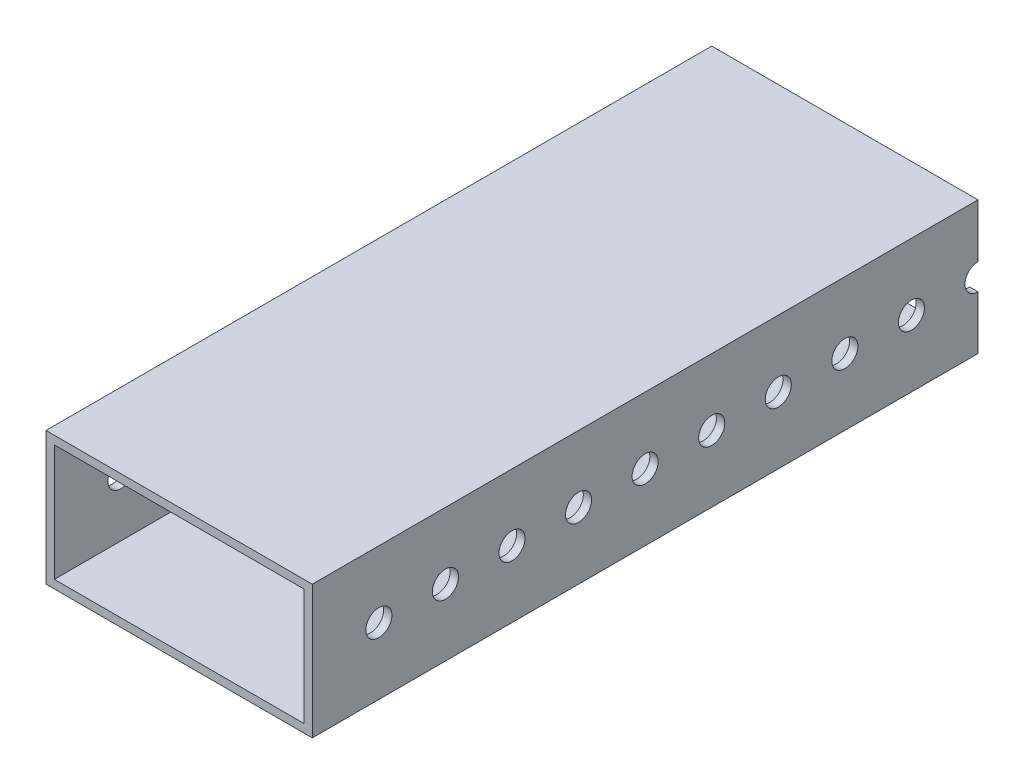
ISO-10303-21;
HEADER;
FILE_DESCRIPTION(('STEP AP214'),'2;1');
FILE_NAME('part.step','',(''),(''),'','','');
FILE_SCHEMA(('AUTOMOTIVE_DESIGN { 1 0 10303 214 1 1 1 1 }'));
ENDSEC;
DATA;
#1=APPLICATION_CONTEXT('core data for automotive mechanical design processes');
#2=APPLICATION_PROTOCOL_DEFINITION('international standard','automotive_design',2000,#1);
#3=PRODUCT_CONTEXT('',#1,'mechanical');
#4=PRODUCT('Part','Part','',(#3));
#5=PRODUCT_RELATED_PRODUCT_CATEGORY('part','',(#4));
#6=PRODUCT_DEFINITION_FORMATION('','',#4);
#7=PRODUCT_DEFINITION_CONTEXT('part definition',#1,'design');
#8=PRODUCT_DEFINITION('design','',#6,#7);
#9=PRODUCT_DEFINITION_SHAPE('','',#8);
#10=(LENGTH_UNIT() NAMED_UNIT(*) SI_UNIT(.MILLI.,.METRE.));
#11=(NAMED_UNIT(*) PLANE_ANGLE_UNIT() SI_UNIT($,.RADIAN.));
#12=(NAMED_UNIT(*) SI_UNIT($,.STERADIAN.) SOLID_ANGLE_UNIT());
#13=UNCERTAINTY_MEASURE_WITH_UNIT(LENGTH_MEASURE(1.E-05),#10,'distance_accuracy_value','');
#14=(GEOMETRIC_REPRESENTATION_CONTEXT(3) GLOBAL_UNCERTAINTY_ASSIGNED_CONTEXT((#13)) GLOBAL_UNIT_ASSIGNED_CONTEXT((#10,
#11,#12)) REPRESENTATION_CONTEXT('',''));
#15=CARTESIAN_POINT('',(0.,0.,0.));
#16=DIRECTION('',(0.,0.,1.));
#17=DIRECTION('',(1.,0.,0.));
#18=AXIS2_PLACEMENT_3D('',#15,#16,#17);
#19=CARTESIAN_POINT('',(0.,0.,0.));
#20=DIRECTION('',(0.,0.,-1.));
#21=DIRECTION('',(-1.,0.,0.));
#22=AXIS2_PLACEMENT_3D('',#19,#20,#21);
#23=PLANE('',#22);
#24=DIRECTION('',(1.,0.,0.));
#25=VECTOR('',#24,1.);
#26=CARTESIAN_POINT('',(0.,15.1892,0.));
#27=LINE('',#26,#25);
#28=CARTESIAN_POINT('',(0.,15.1892,0.));
#29=VERTEX_POINT('',#28);
#30=CARTESIAN_POINT('',(1.5875,15.1892,0.));
#31=VERTEX_POINT('',#30);
#32=EDGE_CURVE('E63',#29,#31,#27,.T.);
#33=ORIENTED_EDGE('',*,*,#32,.F.);
#34=DIRECTION('',(0.,-1.,0.));
#35=VECTOR('',#34,1.);
#36=CARTESIAN_POINT('',(0.,0.,0.));
#37=LINE('',#36,#35);
#38=CARTESIAN_POINT('',(0.,25.4,0.));
#39=VERTEX_POINT('',#38);
#40=EDGE_CURVE('E148',#39,#29,#37,.T.);
#41=ORIENTED_EDGE('',*,*,#40,.F.);
#42=DIRECTION('',(-1.,0.,0.));
#43=VECTOR('',#42,1.);
#44=CARTESIAN_POINT('',(0.,25.4,0.));
#45=LINE('',#44,#43);
#46=CARTESIAN_POINT('',(50.8,25.4,0.));
#47=VERTEX_POINT('',#46);
#48=EDGE_CURVE('E176',#47,#39,#45,.T.);
#49=ORIENTED_EDGE('',*,*,#48,.F.);
#50=DIRECTION('',(0.,1.,0.));
#51=VECTOR('',#50,1.);
#52=CARTESIAN_POINT('',(50.8,0.,0.));
#53=LINE('',#52,#51);
#54=CARTESIAN_POINT('',(50.8,15.1892,0.));
#55=VERTEX_POINT('',#54);
#56=EDGE_CURVE('E165',#55,#47,#53,.T.);
#57=ORIENTED_EDGE('',*,*,#56,.F.);
#58=CARTESIAN_POINT('',(49.2125,15.1892,0.));
#59=VERTEX_POINT('',#58);
#60=EDGE_CURVE('E154',#59,#55,#27,.T.);
#61=ORIENTED_EDGE('',*,*,#60,.F.);
#62=DIRECTION('',(0.,1.,0.));
#63=VECTOR('',#62,1.);
#64=CARTESIAN_POINT('',(49.2125,1.5875,0.));
#65=LINE('',#64,#63);
#66=CARTESIAN_POINT('',(49.2125,23.8125,0.));
#67=VERTEX_POINT('',#66);
#68=EDGE_CURVE('E269',#59,#67,#65,.T.);
#69=ORIENTED_EDGE('',*,*,#68,.T.);
#70=DIRECTION('',(-1.,0.,0.));
#71=VECTOR('',#70,1.);
#72=CARTESIAN_POINT('',(1.5875,23.8125,0.));
#73=LINE('',#72,#71);
#74=CARTESIAN_POINT('',(1.5875,23.8125,0.));
#75=VERTEX_POINT('',#74);
#76=EDGE_CURVE('E252',#67,#75,#73,.T.);
#77=ORIENTED_EDGE('',*,*,#76,.T.);
#78=DIRECTION('',(0.,-1.,0.));
#79=VECTOR('',#78,1.);
#80=CARTESIAN_POINT('',(1.5875,1.5875,0.));
#81=LINE('',#80,#79);
#82=EDGE_CURVE('E150',#75,#31,#81,.T.);
#83=ORIENTED_EDGE('',*,*,#82,.T.);
#84=EDGE_LOOP('',(#33,#41,#49,#57,#61,#69,#77,#83));
#85=FACE_BOUND('',#84,.T.);
#86=ADVANCED_FACE('F45',(#85),#23,.T.);
#87=CARTESIAN_POINT('',(0.,0.,127.));
#88=DIRECTION('',(0.,0.,-1.));
#89=DIRECTION('',(-1.,0.,0.));
#90=AXIS2_PLACEMENT_3D('',#87,#88,#89);
#91=PLANE('',#90);
#92=DIRECTION('',(0.,-1.,0.));
#93=VECTOR('',#92,1.);
#94=CARTESIAN_POINT('',(0.,0.,127.));
#95=LINE('',#94,#93);
#96=CARTESIAN_POINT('',(0.,25.4,127.));
#97=VERTEX_POINT('',#96);
#98=CARTESIAN_POINT('',(0.,0.,127.));
#99=VERTEX_POINT('',#98);
#100=EDGE_CURVE('E179',#97,#99,#95,.T.);
#101=ORIENTED_EDGE('',*,*,#100,.T.);
#102=DIRECTION('',(1.,0.,0.));
#103=VECTOR('',#102,1.);
#104=CARTESIAN_POINT('',(0.,0.,127.));
#105=LINE('',#104,#103);
#106=CARTESIAN_POINT('',(50.8,0.,127.));
#107=VERTEX_POINT('',#106);
#108=EDGE_CURVE('E292',#99,#107,#105,.T.);
#109=ORIENTED_EDGE('',*,*,#108,.T.);
#110=DIRECTION('',(0.,1.,0.));
#111=VECTOR('',#110,1.);
#112=CARTESIAN_POINT('',(50.8,0.,127.));
#113=LINE('',#112,#111);
#114=CARTESIAN_POINT('',(50.8,25.4,127.));
#115=VERTEX_POINT('',#114);
#116=EDGE_CURVE('E294',#107,#115,#113,.T.);
#117=ORIENTED_EDGE('',*,*,#116,.T.);
#118=DIRECTION('',(-1.,0.,0.));
#119=VECTOR('',#118,1.);
#120=CARTESIAN_POINT('',(0.,25.4,127.));
#121=LINE('',#120,#119);
#122=EDGE_CURVE('E169',#115,#97,#121,.T.);
#123=ORIENTED_EDGE('',*,*,#122,.T.);
#124=EDGE_LOOP('',(#101,#109,#117,#123));
#125=FACE_BOUND('',#124,.T.);
#126=DIRECTION('',(0.,-1.,0.));
#127=VECTOR('',#126,1.);
#128=CARTESIAN_POINT('',(1.5875,1.5875,127.));
#129=LINE('',#128,#127);
#130=CARTESIAN_POINT('',(1.5875,23.8125,127.));
#131=VERTEX_POINT('',#130);
#132=CARTESIAN_POINT('',(1.5875,1.5875,127.));
#133=VERTEX_POINT('',#132);
#134=EDGE_CURVE('E248',#131,#133,#129,.T.);
#135=ORIENTED_EDGE('',*,*,#134,.F.);
#136=DIRECTION('',(-1.,0.,0.));
#137=VECTOR('',#136,1.);
#138=CARTESIAN_POINT('',(1.5875,23.8125,127.));
#139=LINE('',#138,#137);
#140=CARTESIAN_POINT('',(49.2125,23.8125,127.));
#141=VERTEX_POINT('',#140);
#142=EDGE_CURVE('E259',#141,#131,#139,.T.);
#143=ORIENTED_EDGE('',*,*,#142,.F.);
#144=DIRECTION('',(0.,1.,0.));
#145=VECTOR('',#144,1.);
#146=CARTESIAN_POINT('',(49.2125,1.5875,127.));
#147=LINE('',#146,#145);
#148=CARTESIAN_POINT('',(49.2125,1.5875,127.));
#149=VERTEX_POINT('',#148);
#150=EDGE_CURVE('E255',#149,#141,#147,.T.);
#151=ORIENTED_EDGE('',*,*,#150,.F.);
#152=DIRECTION('',(1.,0.,0.));
#153=VECTOR('',#152,1.);
#154=CARTESIAN_POINT('',(1.5875,1.5875,127.));
#155=LINE('',#154,#153);
#156=EDGE_CURVE('E251',#133,#149,#155,.T.);
#157=ORIENTED_EDGE('',*,*,#156,.F.);
#158=EDGE_LOOP('',(#135,#143,#151,#157));
#159=FACE_BOUND('',#158,.T.);
#160=ADVANCED_FACE('F301',(#125,#159),#91,.F.);
#161=DIRECTION('',(1.,0.,0.));
#162=VECTOR('',#161,1.);
#163=CARTESIAN_POINT('',(0.,10.2108,0.));
#164=LINE('',#163,#162);
#165=CARTESIAN_POINT('',(50.8,10.2108,0.));
#166=VERTEX_POINT('',#165);
#167=CARTESIAN_POINT('',(49.2125,10.2108,0.));
#168=VERTEX_POINT('',#167);
#169=EDGE_CURVE('E70',#166,#168,#164,.F.);
#170=ORIENTED_EDGE('',*,*,#169,.F.);
#171=CARTESIAN_POINT('',(50.8,0.,0.));
#172=VERTEX_POINT('',#171);
#173=EDGE_CURVE('E172',#172,#166,#53,.T.);
#174=ORIENTED_EDGE('',*,*,#173,.F.);
#175=DIRECTION('',(1.,0.,0.));
#176=VECTOR('',#175,1.);
#177=CARTESIAN_POINT('',(0.,0.,0.));
#178=LINE('',#177,#176);
#179=CARTESIAN_POINT('',(0.,0.,0.));
#180=VERTEX_POINT('',#179);
#181=EDGE_CURVE('E160',#180,#172,#178,.T.);
#182=ORIENTED_EDGE('',*,*,#181,.F.);
#183=CARTESIAN_POINT('',(0.,10.2108,0.));
#184=VERTEX_POINT('',#183);
#185=EDGE_CURVE('E161',#184,#180,#37,.T.);
#186=ORIENTED_EDGE('',*,*,#185,.F.);
#187=CARTESIAN_POINT('',(1.5875,10.2108,0.));
#188=VERTEX_POINT('',#187);
#189=EDGE_CURVE('E137',#188,#184,#164,.F.);
#190=ORIENTED_EDGE('',*,*,#189,.F.);
#191=CARTESIAN_POINT('',(1.5875,1.5875,0.));
#192=VERTEX_POINT('',#191);
#193=EDGE_CURVE('E247',#188,#192,#81,.T.);
#194=ORIENTED_EDGE('',*,*,#193,.T.);
#195=DIRECTION('',(1.,0.,0.));
#196=VECTOR('',#195,1.);
#197=CARTESIAN_POINT('',(1.5875,1.5875,0.));
#198=LINE('',#197,#196);
#199=CARTESIAN_POINT('',(49.2125,1.5875,0.));
#200=VERTEX_POINT('',#199);
#201=EDGE_CURVE('E265',#192,#200,#198,.T.);
#202=ORIENTED_EDGE('',*,*,#201,.T.);
#203=EDGE_CURVE('E270',#200,#168,#65,.T.);
#204=ORIENTED_EDGE('',*,*,#203,.T.);
#205=EDGE_LOOP('',(#170,#174,#182,#186,#190,#194,#202,#204));
#206=FACE_BOUND('',#205,.T.);
#207=ADVANCED_FACE('F418',(#206),#23,.T.);
#208=CARTESIAN_POINT('',(0.,0.,127.));
#209=DIRECTION('',(1.,0.,0.));
#210=DIRECTION('',(0.,1.,0.));
#211=AXIS2_PLACEMENT_3D('',#208,#209,#210);
#212=PLANE('',#211);
#213=CARTESIAN_POINT('',(0.,12.7,114.3));
#214=DIRECTION('',(1.,0.,0.));
#215=DIRECTION('',(0.,1.,0.));
#216=AXIS2_PLACEMENT_3D('',#213,#214,#215);
#217=CIRCLE('',#216,2.4892);
#218=CARTESIAN_POINT('',(0.,15.1892,114.3));
#219=VERTEX_POINT('',#218);
#220=EDGE_CURVE('E380',#219,#219,#217,.T.);
#221=ORIENTED_EDGE('',*,*,#220,.T.);
#222=EDGE_LOOP('',(#221));
#223=FACE_BOUND('',#222,.T.);
#224=CARTESIAN_POINT('',(0.,12.7,101.6));
#225=DIRECTION('',(1.,0.,0.));
#226=DIRECTION('',(0.,1.,0.));
#227=AXIS2_PLACEMENT_3D('',#224,#225,#226);
#228=CIRCLE('',#227,2.48920000000002);
#229=CARTESIAN_POINT('',(0.,15.1892,101.6));
#230=VERTEX_POINT('',#229);
#231=EDGE_CURVE('E432',#230,#230,#228,.T.);
#232=ORIENTED_EDGE('',*,*,#231,.T.);
#233=EDGE_LOOP('',(#232));
#234=FACE_BOUND('',#233,.T.);
#235=CARTESIAN_POINT('',(0.,12.7,88.9));
#236=DIRECTION('',(1.,0.,0.));
#237=DIRECTION('',(0.,1.,0.));
#238=AXIS2_PLACEMENT_3D('',#235,#236,#237);
#239=CIRCLE('',#238,2.4892);
#240=CARTESIAN_POINT('',(0.,15.1892,88.9));
#241=VERTEX_POINT('',#240);
#242=EDGE_CURVE('E440',#241,#241,#239,.T.);
#243=ORIENTED_EDGE('',*,*,#242,.T.);
#244=EDGE_LOOP('',(#243));
#245=FACE_BOUND('',#244,.T.);
#246=CARTESIAN_POINT('',(0.,12.7,76.2));
#247=DIRECTION('',(1.,0.,0.));
#248=DIRECTION('',(0.,1.,0.));
#249=AXIS2_PLACEMENT_3D('',#246,#247,#248);
#250=CIRCLE('',#249,2.4892);
#251=CARTESIAN_POINT('',(0.,15.1892,76.2));
#252=VERTEX_POINT('',#251);
#253=EDGE_CURVE('E448',#252,#252,#250,.T.);
#254=ORIENTED_EDGE('',*,*,#253,.T.);
#255=EDGE_LOOP('',(#254));
#256=FACE_BOUND('',#255,.T.);
#257=CARTESIAN_POINT('',(0.,12.7,63.5));
#258=DIRECTION('',(1.,0.,0.));
#259=DIRECTION('',(0.,1.,0.));
#260=AXIS2_PLACEMENT_3D('',#257,#258,#259);
#261=CIRCLE('',#260,2.4892);
#262=CARTESIAN_POINT('',(0.,15.1892,63.5));
#263=VERTEX_POINT('',#262);
#264=EDGE_CURVE('E456',#263,#263,#261,.T.);
#265=ORIENTED_EDGE('',*,*,#264,.T.);
#266=EDGE_LOOP('',(#265));
#267=FACE_BOUND('',#266,.T.);
#268=CARTESIAN_POINT('',(0.,12.7,50.8000000000001));
#269=DIRECTION('',(1.,0.,0.));
#270=DIRECTION('',(0.,1.,0.));
#271=AXIS2_PLACEMENT_3D('',#268,#269,#270);
#272=CIRCLE('',#271,2.4892);
#273=CARTESIAN_POINT('',(0.,15.1892,50.8000000000001));
#274=VERTEX_POINT('',#273);
#275=EDGE_CURVE('E464',#274,#274,#272,.T.);
#276=ORIENTED_EDGE('',*,*,#275,.T.);
#277=EDGE_LOOP('',(#276));
#278=FACE_BOUND('',#277,.T.);
#279=CARTESIAN_POINT('',(0.,12.7,38.1000000000001));
#280=DIRECTION('',(1.,0.,0.));
#281=DIRECTION('',(0.,1.,0.));
#282=AXIS2_PLACEMENT_3D('',#279,#280,#281);
#283=CIRCLE('',#282,2.4892);
#284=CARTESIAN_POINT('',(0.,15.1892,38.1000000000001));
#285=VERTEX_POINT('',#284);
#286=EDGE_CURVE('E472',#285,#285,#283,.T.);
#287=ORIENTED_EDGE('',*,*,#286,.T.);
#288=EDGE_LOOP('',(#287));
#289=FACE_BOUND('',#288,.T.);
#290=CARTESIAN_POINT('',(0.,12.7,25.4000000000001));
#291=DIRECTION('',(1.,0.,0.));
#292=DIRECTION('',(0.,1.,0.));
#293=AXIS2_PLACEMENT_3D('',#290,#291,#292);
#294=CIRCLE('',#293,2.4892);
#295=CARTESIAN_POINT('',(0.,15.1892,25.4000000000001));
#296=VERTEX_POINT('',#295);
#297=EDGE_CURVE('E365',#296,#296,#294,.T.);
#298=ORIENTED_EDGE('',*,*,#297,.T.);
#299=EDGE_LOOP('',(#298));
#300=FACE_BOUND('',#299,.T.);
#301=CARTESIAN_POINT('',(0.,12.7,12.7000000000001));
#302=DIRECTION('',(1.,0.,0.));
#303=DIRECTION('',(0.,1.,0.));
#304=AXIS2_PLACEMENT_3D('',#301,#302,#303);
#305=CIRCLE('',#304,2.4892);
#306=CARTESIAN_POINT('',(0.,15.1892,12.7000000000001));
#307=VERTEX_POINT('',#306);
#308=EDGE_CURVE('E366',#307,#307,#305,.T.);
#309=ORIENTED_EDGE('',*,*,#308,.T.);
#310=EDGE_LOOP('',(#309));
#311=FACE_BOUND('',#310,.T.);
#312=ORIENTED_EDGE('',*,*,#40,.T.);
#313=CARTESIAN_POINT('',(0.,12.7,0.));
#314=DIRECTION('',(1.,0.,0.));
#315=DIRECTION('',(0.,1.,0.));
#316=AXIS2_PLACEMENT_3D('',#313,#314,#315);
#317=CIRCLE('',#316,2.4892);
#318=EDGE_CURVE('E134',#29,#184,#317,.T.);
#319=ORIENTED_EDGE('',*,*,#318,.T.);
#320=ORIENTED_EDGE('',*,*,#185,.T.);
#321=DIRECTION('',(0.,0.,-1.));
#322=VECTOR('',#321,1.);
#323=CARTESIAN_POINT('',(0.,0.,127.));
#324=LINE('',#323,#322);
#325=EDGE_CURVE('E55',#99,#180,#324,.T.);
#326=ORIENTED_EDGE('',*,*,#325,.F.);
#327=ORIENTED_EDGE('',*,*,#100,.F.);
#328=DIRECTION('',(0.,0.,-1.));
#329=VECTOR('',#328,1.);
#330=CARTESIAN_POINT('',(0.,25.4,127.));
#331=LINE('',#330,#329);
#332=EDGE_CURVE('E158',#97,#39,#331,.T.);
#333=ORIENTED_EDGE('',*,*,#332,.T.);
#334=EDGE_LOOP('',(#312,#319,#320,#326,#327,#333));
#335=FACE_BOUND('',#334,.T.);
#336=ADVANCED_FACE('F47',(#223,#234,#245,#256,#267,#278,#289,#300,#311,#335),#212,.F.);
#337=CARTESIAN_POINT('',(0.,0.,127.));
#338=DIRECTION('',(0.,1.,0.));
#339=DIRECTION('',(0.,0.,1.));
#340=AXIS2_PLACEMENT_3D('',#337,#338,#339);
#341=PLANE('',#340);
#342=ORIENTED_EDGE('',*,*,#181,.T.);
#343=DIRECTION('',(0.,0.,-1.));
#344=VECTOR('',#343,1.);
#345=CARTESIAN_POINT('',(50.8,0.,127.));
#346=LINE('',#345,#344);
#347=EDGE_CURVE('E186',#107,#172,#346,.T.);
#348=ORIENTED_EDGE('',*,*,#347,.F.);
#349=ORIENTED_EDGE('',*,*,#108,.F.);
#350=ORIENTED_EDGE('',*,*,#325,.T.);
#351=EDGE_LOOP('',(#342,#348,#349,#350));
#352=FACE_BOUND('',#351,.T.);
#353=ADVANCED_FACE('F308',(#352),#341,.F.);
#354=CARTESIAN_POINT('',(50.8,0.,127.));
#355=DIRECTION('',(-1.,0.,0.));
#356=DIRECTION('',(0.,-1.,0.));
#357=AXIS2_PLACEMENT_3D('',#354,#355,#356);
#358=PLANE('',#357);
#359=CARTESIAN_POINT('',(50.8,12.7,114.3));
#360=DIRECTION('',(1.,0.,0.));
#361=DIRECTION('',(0.,1.,0.));
#362=AXIS2_PLACEMENT_3D('',#359,#360,#361);
#363=CIRCLE('',#362,2.4892);
#364=CARTESIAN_POINT('',(50.8,15.1892,114.3));
#365=VERTEX_POINT('',#364);
#366=EDGE_CURVE('E424',#365,#365,#363,.T.);
#367=ORIENTED_EDGE('',*,*,#366,.F.);
#368=EDGE_LOOP('',(#367));
#369=FACE_BOUND('',#368,.T.);
#370=CARTESIAN_POINT('',(50.8,12.7,101.6));
#371=DIRECTION('',(1.,0.,0.));
#372=DIRECTION('',(0.,1.,0.));
#373=AXIS2_PLACEMENT_3D('',#370,#371,#372);
#374=CIRCLE('',#373,2.48920000000002);
#375=CARTESIAN_POINT('',(50.8,15.1892,101.6));
#376=VERTEX_POINT('',#375);
#377=EDGE_CURVE('E428',#376,#376,#374,.T.);
#378=ORIENTED_EDGE('',*,*,#377,.F.);
#379=EDGE_LOOP('',(#378));
#380=FACE_BOUND('',#379,.T.);
#381=CARTESIAN_POINT('',(50.8,12.7,88.9));
#382=DIRECTION('',(1.,0.,0.));
#383=DIRECTION('',(0.,1.,0.));
#384=AXIS2_PLACEMENT_3D('',#381,#382,#383);
#385=CIRCLE('',#384,2.4892);
#386=CARTESIAN_POINT('',(50.8,15.1892,88.9));
#387=VERTEX_POINT('',#386);
#388=EDGE_CURVE('E436',#387,#387,#385,.T.);
#389=ORIENTED_EDGE('',*,*,#388,.F.);
#390=EDGE_LOOP('',(#389));
#391=FACE_BOUND('',#390,.T.);
#392=CARTESIAN_POINT('',(50.8,12.7,76.2));
#393=DIRECTION('',(1.,0.,0.));
#394=DIRECTION('',(0.,1.,0.));
#395=AXIS2_PLACEMENT_3D('',#392,#393,#394);
#396=CIRCLE('',#395,2.4892);
#397=CARTESIAN_POINT('',(50.8,15.1892,76.2));
#398=VERTEX_POINT('',#397);
#399=EDGE_CURVE('E444',#398,#398,#396,.T.);
#400=ORIENTED_EDGE('',*,*,#399,.F.);
#401=EDGE_LOOP('',(#400));
#402=FACE_BOUND('',#401,.T.);
#403=CARTESIAN_POINT('',(50.8,12.7,63.5));
#404=DIRECTION('',(1.,0.,0.));
#405=DIRECTION('',(0.,1.,0.));
#406=AXIS2_PLACEMENT_3D('',#403,#404,#405);
#407=CIRCLE('',#406,2.4892);
#408=CARTESIAN_POINT('',(50.8,15.1892,63.5));
#409=VERTEX_POINT('',#408);
#410=EDGE_CURVE('E452',#409,#409,#407,.T.);
#411=ORIENTED_EDGE('',*,*,#410,.F.);
#412=EDGE_LOOP('',(#411));
#413=FACE_BOUND('',#412,.T.);
#414=CARTESIAN_POINT('',(50.8,12.7,50.8000000000001));
#415=DIRECTION('',(1.,0.,0.));
#416=DIRECTION('',(0.,1.,0.));
#417=AXIS2_PLACEMENT_3D('',#414,#415,#416);
#418=CIRCLE('',#417,2.4892);
#419=CARTESIAN_POINT('',(50.8,15.1892,50.8000000000001));
#420=VERTEX_POINT('',#419);
#421=EDGE_CURVE('E460',#420,#420,#418,.T.);
#422=ORIENTED_EDGE('',*,*,#421,.F.);
#423=EDGE_LOOP('',(#422));
#424=FACE_BOUND('',#423,.T.);
#425=CARTESIAN_POINT('',(50.8,12.7,38.1000000000001));
#426=DIRECTION('',(1.,0.,0.));
#427=DIRECTION('',(0.,1.,0.));
#428=AXIS2_PLACEMENT_3D('',#425,#426,#427);
#429=CIRCLE('',#428,2.4892);
#430=CARTESIAN_POINT('',(50.8,15.1892,38.1000000000001));
#431=VERTEX_POINT('',#430);
#432=EDGE_CURVE('E468',#431,#431,#429,.T.);
#433=ORIENTED_EDGE('',*,*,#432,.F.);
#434=EDGE_LOOP('',(#433));
#435=FACE_BOUND('',#434,.T.);
#436=CARTESIAN_POINT('',(50.8,12.7,25.4000000000001));
#437=DIRECTION('',(1.,0.,0.));
#438=DIRECTION('',(0.,1.,0.));
#439=AXIS2_PLACEMENT_3D('',#436,#437,#438);
#440=CIRCLE('',#439,2.4892);
#441=CARTESIAN_POINT('',(50.8,15.1892,25.4000000000001));
#442=VERTEX_POINT('',#441);
#443=EDGE_CURVE('E371',#442,#442,#440,.T.);
#444=ORIENTED_EDGE('',*,*,#443,.F.);
#445=EDGE_LOOP('',(#444));
#446=FACE_BOUND('',#445,.T.);
#447=CARTESIAN_POINT('',(50.8,12.7,12.7000000000001));
#448=DIRECTION('',(1.,0.,0.));
#449=DIRECTION('',(0.,1.,0.));
#450=AXIS2_PLACEMENT_3D('',#447,#448,#449);
#451=CIRCLE('',#450,2.4892);
#452=CARTESIAN_POINT('',(50.8,15.1892,12.7000000000001));
#453=VERTEX_POINT('',#452);
#454=EDGE_CURVE('E362',#453,#453,#451,.T.);
#455=ORIENTED_EDGE('',*,*,#454,.F.);
#456=EDGE_LOOP('',(#455));
#457=FACE_BOUND('',#456,.T.);
#458=ORIENTED_EDGE('',*,*,#173,.T.);
#459=CARTESIAN_POINT('',(50.8,12.7,0.));
#460=DIRECTION('',(1.,0.,0.));
#461=DIRECTION('',(0.,1.,0.));
#462=AXIS2_PLACEMENT_3D('',#459,#460,#461);
#463=CIRCLE('',#462,2.4892);
#464=EDGE_CURVE('E142',#55,#166,#463,.T.);
#465=ORIENTED_EDGE('',*,*,#464,.F.);
#466=ORIENTED_EDGE('',*,*,#56,.T.);
#467=DIRECTION('',(0.,0.,-1.));
#468=VECTOR('',#467,1.);
#469=CARTESIAN_POINT('',(50.8,25.4,127.));
#470=LINE('',#469,#468);
#471=EDGE_CURVE('E182',#115,#47,#470,.T.);
#472=ORIENTED_EDGE('',*,*,#471,.F.);
#473=ORIENTED_EDGE('',*,*,#116,.F.);
#474=ORIENTED_EDGE('',*,*,#347,.T.);
#475=EDGE_LOOP('',(#458,#465,#466,#472,#473,#474));
#476=FACE_BOUND('',#475,.T.);
#477=ADVANCED_FACE('F312',(#369,#380,#391,#402,#413,#424,#435,#446,#457,#476),#358,.F.);
#478=CARTESIAN_POINT('',(0.,25.4,127.));
#479=DIRECTION('',(0.,-1.,0.));
#480=DIRECTION('',(0.,0.,-1.));
#481=AXIS2_PLACEMENT_3D('',#478,#479,#480);
#482=PLANE('',#481);
#483=ORIENTED_EDGE('',*,*,#48,.T.);
#484=ORIENTED_EDGE('',*,*,#332,.F.);
#485=ORIENTED_EDGE('',*,*,#122,.F.);
#486=ORIENTED_EDGE('',*,*,#471,.T.);
#487=EDGE_LOOP('',(#483,#484,#485,#486));
#488=FACE_BOUND('',#487,.T.);
#489=ADVANCED_FACE('F305',(#488),#482,.F.);
#490=CARTESIAN_POINT('',(1.5875,1.5875,127.));
#491=DIRECTION('',(1.,0.,0.));
#492=DIRECTION('',(0.,0.,-1.));
#493=AXIS2_PLACEMENT_3D('',#490,#491,#492);
#494=PLANE('',#493);
#495=CARTESIAN_POINT('',(1.5875,12.7,114.3));
#496=DIRECTION('',(1.,0.,0.));
#497=DIRECTION('',(0.,0.,-1.));
#498=AXIS2_PLACEMENT_3D('',#495,#496,#497);
#499=CIRCLE('',#498,2.4892);
#500=CARTESIAN_POINT('',(1.5875,12.7,111.8108));
#501=VERTEX_POINT('',#500);
#502=EDGE_CURVE('E243',#501,#501,#499,.T.);
#503=ORIENTED_EDGE('',*,*,#502,.F.);
#504=EDGE_LOOP('',(#503));
#505=FACE_BOUND('',#504,.T.);
#506=CARTESIAN_POINT('',(1.5875,12.7,101.6));
#507=DIRECTION('',(1.,0.,0.));
#508=DIRECTION('',(0.,0.,-1.));
#509=AXIS2_PLACEMENT_3D('',#506,#507,#508);
#510=CIRCLE('',#509,2.48920000000002);
#511=CARTESIAN_POINT('',(1.5875,12.7,99.1108));
#512=VERTEX_POINT('',#511);
#513=EDGE_CURVE('E229',#512,#512,#510,.T.);
#514=ORIENTED_EDGE('',*,*,#513,.F.);
#515=EDGE_LOOP('',(#514));
#516=FACE_BOUND('',#515,.T.);
#517=CARTESIAN_POINT('',(1.5875,12.7,88.9));
#518=DIRECTION('',(1.,0.,0.));
#519=DIRECTION('',(0.,0.,-1.));
#520=AXIS2_PLACEMENT_3D('',#517,#518,#519);
#521=CIRCLE('',#520,2.4892);
#522=CARTESIAN_POINT('',(1.5875,12.7,86.4108));
#523=VERTEX_POINT('',#522);
#524=EDGE_CURVE('E225',#523,#523,#521,.T.);
#525=ORIENTED_EDGE('',*,*,#524,.F.);
#526=EDGE_LOOP('',(#525));
#527=FACE_BOUND('',#526,.T.);
#528=CARTESIAN_POINT('',(1.5875,12.7,76.2));
#529=DIRECTION('',(1.,0.,0.));
#530=DIRECTION('',(0.,0.,-1.));
#531=AXIS2_PLACEMENT_3D('',#528,#529,#530);
#532=CIRCLE('',#531,2.4892);
#533=CARTESIAN_POINT('',(1.5875,12.7,73.7108));
#534=VERTEX_POINT('',#533);
#535=EDGE_CURVE('E221',#534,#534,#532,.T.);
#536=ORIENTED_EDGE('',*,*,#535,.F.);
#537=EDGE_LOOP('',(#536));
#538=FACE_BOUND('',#537,.T.);
#539=CARTESIAN_POINT('',(1.5875,12.7,63.5));
#540=DIRECTION('',(1.,0.,0.));
#541=DIRECTION('',(0.,0.,-1.));
#542=AXIS2_PLACEMENT_3D('',#539,#540,#541);
#543=CIRCLE('',#542,2.4892);
#544=CARTESIAN_POINT('',(1.5875,12.7,61.0108));
#545=VERTEX_POINT('',#544);
#546=EDGE_CURVE('E216',#545,#545,#543,.T.);
#547=ORIENTED_EDGE('',*,*,#546,.F.);
#548=EDGE_LOOP('',(#547));
#549=FACE_BOUND('',#548,.T.);
#550=CARTESIAN_POINT('',(1.5875,12.7,50.8000000000001));
#551=DIRECTION('',(1.,0.,0.));
#552=DIRECTION('',(0.,0.,-1.));
#553=AXIS2_PLACEMENT_3D('',#550,#551,#552);
#554=CIRCLE('',#553,2.4892);
#555=CARTESIAN_POINT('',(1.5875,12.7,48.3108000000001));
#556=VERTEX_POINT('',#555);
#557=EDGE_CURVE('E211',#556,#556,#554,.T.);
#558=ORIENTED_EDGE('',*,*,#557,.F.);
#559=EDGE_LOOP('',(#558));
#560=FACE_BOUND('',#559,.T.);
#561=CARTESIAN_POINT('',(1.5875,12.7,38.1000000000001));
#562=DIRECTION('',(1.,0.,0.));
#563=DIRECTION('',(0.,0.,-1.));
#564=AXIS2_PLACEMENT_3D('',#561,#562,#563);
#565=CIRCLE('',#564,2.4892);
#566=CARTESIAN_POINT('',(1.5875,12.7,35.6108000000001));
#567=VERTEX_POINT('',#566);
#568=EDGE_CURVE('E206',#567,#567,#565,.T.);
#569=ORIENTED_EDGE('',*,*,#568,.F.);
#570=EDGE_LOOP('',(#569));
#571=FACE_BOUND('',#570,.T.);
#572=CARTESIAN_POINT('',(1.5875,12.7,25.4000000000001));
#573=DIRECTION('',(1.,0.,0.));
#574=DIRECTION('',(0.,0.,-1.));
#575=AXIS2_PLACEMENT_3D('',#572,#573,#574);
#576=CIRCLE('',#575,2.4892);
#577=CARTESIAN_POINT('',(1.5875,12.7,22.9108000000001));
#578=VERTEX_POINT('',#577);
#579=EDGE_CURVE('E201',#578,#578,#576,.T.);
#580=ORIENTED_EDGE('',*,*,#579,.F.);
#581=EDGE_LOOP('',(#580));
#582=FACE_BOUND('',#581,.T.);
#583=CARTESIAN_POINT('',(1.5875,12.7,12.7000000000001));
#584=DIRECTION('',(1.,0.,0.));
#585=DIRECTION('',(0.,0.,-1.));
#586=AXIS2_PLACEMENT_3D('',#583,#584,#585);
#587=CIRCLE('',#586,2.4892);
#588=CARTESIAN_POINT('',(1.5875,12.7,10.2108000000001));
#589=VERTEX_POINT('',#588);
#590=EDGE_CURVE('E196',#589,#589,#587,.T.);
#591=ORIENTED_EDGE('',*,*,#590,.F.);
#592=EDGE_LOOP('',(#591));
#593=FACE_BOUND('',#592,.T.);
#594=CARTESIAN_POINT('',(1.5875,12.7,0.));
#595=DIRECTION('',(1.,0.,0.));
#596=DIRECTION('',(0.,0.,-1.));
#597=AXIS2_PLACEMENT_3D('',#594,#595,#596);
#598=CIRCLE('',#597,2.4892);
#599=EDGE_CURVE('E319',#31,#188,#598,.T.);
#600=ORIENTED_EDGE('',*,*,#599,.F.);
#601=ORIENTED_EDGE('',*,*,#82,.F.);
#602=DIRECTION('',(0.,0.,-1.));
#603=VECTOR('',#602,1.);
#604=CARTESIAN_POINT('',(1.5875,23.8125,127.));
#605=LINE('',#604,#603);
#606=EDGE_CURVE('E262',#131,#75,#605,.T.);
#607=ORIENTED_EDGE('',*,*,#606,.F.);
#608=ORIENTED_EDGE('',*,*,#134,.T.);
#609=DIRECTION('',(0.,0.,-1.));
#610=VECTOR('',#609,1.);
#611=CARTESIAN_POINT('',(1.5875,1.5875,127.));
#612=LINE('',#611,#610);
#613=EDGE_CURVE('E167',#133,#192,#612,.T.);
#614=ORIENTED_EDGE('',*,*,#613,.T.);
#615=ORIENTED_EDGE('',*,*,#193,.F.);
#616=EDGE_LOOP('',(#600,#601,#607,#608,#614,#615));
#617=FACE_BOUND('',#616,.T.);
#618=ADVANCED_FACE('F402',(#505,#516,#527,#538,#549,#560,#571,#582,#593,#617),#494,.T.);
#619=CARTESIAN_POINT('',(1.5875,1.5875,127.));
#620=DIRECTION('',(0.,1.,0.));
#621=DIRECTION('',(0.,0.,1.));
#622=AXIS2_PLACEMENT_3D('',#619,#620,#621);
#623=PLANE('',#622);
#624=ORIENTED_EDGE('',*,*,#201,.F.);
#625=ORIENTED_EDGE('',*,*,#613,.F.);
#626=ORIENTED_EDGE('',*,*,#156,.T.);
#627=DIRECTION('',(0.,0.,-1.));
#628=VECTOR('',#627,1.);
#629=CARTESIAN_POINT('',(49.2125,1.5875,127.));
#630=LINE('',#629,#628);
#631=EDGE_CURVE('E283',#149,#200,#630,.T.);
#632=ORIENTED_EDGE('',*,*,#631,.T.);
#633=EDGE_LOOP('',(#624,#625,#626,#632));
#634=FACE_BOUND('',#633,.T.);
#635=ADVANCED_FACE('F336',(#634),#623,.T.);
#636=CARTESIAN_POINT('',(49.2125,1.5875,127.));
#637=DIRECTION('',(-1.,0.,0.));
#638=DIRECTION('',(0.,0.,1.));
#639=AXIS2_PLACEMENT_3D('',#636,#637,#638);
#640=PLANE('',#639);
#641=CARTESIAN_POINT('',(49.2125,12.7,114.3));
#642=DIRECTION('',(-1.,0.,0.));
#643=DIRECTION('',(0.,0.,1.));
#644=AXIS2_PLACEMENT_3D('',#641,#642,#643);
#645=CIRCLE('',#644,2.4892);
#646=CARTESIAN_POINT('',(49.2125,12.7,116.7892));
#647=VERTEX_POINT('',#646);
#648=EDGE_CURVE('E49',#647,#647,#645,.T.);
#649=ORIENTED_EDGE('',*,*,#648,.F.);
#650=EDGE_LOOP('',(#649));
#651=FACE_BOUND('',#650,.T.);
#652=CARTESIAN_POINT('',(49.2125,12.7,101.6));
#653=DIRECTION('',(-1.,0.,0.));
#654=DIRECTION('',(0.,0.,1.));
#655=AXIS2_PLACEMENT_3D('',#652,#653,#654);
#656=CIRCLE('',#655,2.48920000000002);
#657=CARTESIAN_POINT('',(49.2125,12.7,104.0892));
#658=VERTEX_POINT('',#657);
#659=EDGE_CURVE('E226',#658,#658,#656,.T.);
#660=ORIENTED_EDGE('',*,*,#659,.F.);
#661=EDGE_LOOP('',(#660));
#662=FACE_BOUND('',#661,.T.);
#663=CARTESIAN_POINT('',(49.2125,12.7,88.9));
#664=DIRECTION('',(-1.,0.,0.));
#665=DIRECTION('',(0.,0.,1.));
#666=AXIS2_PLACEMENT_3D('',#663,#664,#665);
#667=CIRCLE('',#666,2.4892);
#668=CARTESIAN_POINT('',(49.2125,12.7,91.3892));
#669=VERTEX_POINT('',#668);
#670=EDGE_CURVE('E222',#669,#669,#667,.T.);
#671=ORIENTED_EDGE('',*,*,#670,.F.);
#672=EDGE_LOOP('',(#671));
#673=FACE_BOUND('',#672,.T.);
#674=CARTESIAN_POINT('',(49.2125,12.7,76.2));
#675=DIRECTION('',(-1.,0.,0.));
#676=DIRECTION('',(0.,0.,1.));
#677=AXIS2_PLACEMENT_3D('',#674,#675,#676);
#678=CIRCLE('',#677,2.4892);
#679=CARTESIAN_POINT('',(49.2125,12.7,78.6892));
#680=VERTEX_POINT('',#679);
#681=EDGE_CURVE('E217',#680,#680,#678,.T.);
#682=ORIENTED_EDGE('',*,*,#681,.F.);
#683=EDGE_LOOP('',(#682));
#684=FACE_BOUND('',#683,.T.);
#685=CARTESIAN_POINT('',(49.2125,12.7,63.5));
#686=DIRECTION('',(-1.,0.,0.));
#687=DIRECTION('',(0.,0.,1.));
#688=AXIS2_PLACEMENT_3D('',#685,#686,#687);
#689=CIRCLE('',#688,2.4892);
#690=CARTESIAN_POINT('',(49.2125,12.7,65.9892000000001));
#691=VERTEX_POINT('',#690);
#692=EDGE_CURVE('E212',#691,#691,#689,.T.);
#693=ORIENTED_EDGE('',*,*,#692,.F.);
#694=EDGE_LOOP('',(#693));
#695=FACE_BOUND('',#694,.T.);
#696=CARTESIAN_POINT('',(49.2125,12.7,50.8000000000001));
#697=DIRECTION('',(-1.,0.,0.));
#698=DIRECTION('',(0.,0.,1.));
#699=AXIS2_PLACEMENT_3D('',#696,#697,#698);
#700=CIRCLE('',#699,2.4892);
#701=CARTESIAN_POINT('',(49.2125,12.7,53.2892000000001));
#702=VERTEX_POINT('',#701);
#703=EDGE_CURVE('E207',#702,#702,#700,.T.);
#704=ORIENTED_EDGE('',*,*,#703,.F.);
#705=EDGE_LOOP('',(#704));
#706=FACE_BOUND('',#705,.T.);
#707=CARTESIAN_POINT('',(49.2125,12.7,38.1000000000001));
#708=DIRECTION('',(-1.,0.,0.));
#709=DIRECTION('',(0.,0.,1.));
#710=AXIS2_PLACEMENT_3D('',#707,#708,#709);
#711=CIRCLE('',#710,2.4892);
#712=CARTESIAN_POINT('',(49.2125,12.7,40.5892000000001));
#713=VERTEX_POINT('',#712);
#714=EDGE_CURVE('E202',#713,#713,#711,.T.);
#715=ORIENTED_EDGE('',*,*,#714,.F.);
#716=EDGE_LOOP('',(#715));
#717=FACE_BOUND('',#716,.T.);
#718=CARTESIAN_POINT('',(49.2125,12.7,25.4000000000001));
#719=DIRECTION('',(-1.,0.,0.));
#720=DIRECTION('',(0.,0.,1.));
#721=AXIS2_PLACEMENT_3D('',#718,#719,#720);
#722=CIRCLE('',#721,2.4892);
#723=CARTESIAN_POINT('',(49.2125,12.7,27.8892000000001));
#724=VERTEX_POINT('',#723);
#725=EDGE_CURVE('E197',#724,#724,#722,.T.);
#726=ORIENTED_EDGE('',*,*,#725,.F.);
#727=EDGE_LOOP('',(#726));
#728=FACE_BOUND('',#727,.T.);
#729=CARTESIAN_POINT('',(49.2125,12.7,12.7000000000001));
#730=DIRECTION('',(-1.,0.,0.));
#731=DIRECTION('',(0.,0.,1.));
#732=AXIS2_PLACEMENT_3D('',#729,#730,#731);
#733=CIRCLE('',#732,2.4892);
#734=CARTESIAN_POINT('',(49.2125,12.7,15.1892000000001));
#735=VERTEX_POINT('',#734);
#736=EDGE_CURVE('E152',#735,#735,#733,.T.);
#737=ORIENTED_EDGE('',*,*,#736,.F.);
#738=EDGE_LOOP('',(#737));
#739=FACE_BOUND('',#738,.T.);
#740=CARTESIAN_POINT('',(49.2125,12.7,0.));
#741=DIRECTION('',(-1.,0.,0.));
#742=DIRECTION('',(0.,0.,1.));
#743=AXIS2_PLACEMENT_3D('',#740,#741,#742);
#744=CIRCLE('',#743,2.4892);
#745=EDGE_CURVE('E11',#168,#59,#744,.T.);
#746=ORIENTED_EDGE('',*,*,#745,.F.);
#747=ORIENTED_EDGE('',*,*,#203,.F.);
#748=ORIENTED_EDGE('',*,*,#631,.F.);
#749=ORIENTED_EDGE('',*,*,#150,.T.);
#750=DIRECTION('',(0.,0.,-1.));
#751=VECTOR('',#750,1.);
#752=CARTESIAN_POINT('',(49.2125,23.8125,127.));
#753=LINE('',#752,#751);
#754=EDGE_CURVE('E279',#141,#67,#753,.T.);
#755=ORIENTED_EDGE('',*,*,#754,.T.);
#756=ORIENTED_EDGE('',*,*,#68,.F.);
#757=EDGE_LOOP('',(#746,#747,#748,#749,#755,#756));
#758=FACE_BOUND('',#757,.T.);
#759=ADVANCED_FACE('F321',(#651,#662,#673,#684,#695,#706,#717,#728,#739,#758),#640,.T.);
#760=CARTESIAN_POINT('',(1.5875,23.8125,127.));
#761=DIRECTION('',(0.,-1.,0.));
#762=DIRECTION('',(0.,0.,-1.));
#763=AXIS2_PLACEMENT_3D('',#760,#761,#762);
#764=PLANE('',#763);
#765=ORIENTED_EDGE('',*,*,#76,.F.);
#766=ORIENTED_EDGE('',*,*,#754,.F.);
#767=ORIENTED_EDGE('',*,*,#142,.T.);
#768=ORIENTED_EDGE('',*,*,#606,.T.);
#769=EDGE_LOOP('',(#765,#766,#767,#768));
#770=FACE_BOUND('',#769,.T.);
#771=ADVANCED_FACE('F335',(#770),#764,.T.);
#772=CARTESIAN_POINT('',(0.,12.7,0.));
#773=DIRECTION('',(1.,0.,0.));
#774=DIRECTION('',(0.,1.,0.));
#775=AXIS2_PLACEMENT_3D('',#772,#773,#774);
#776=CYLINDRICAL_SURFACE('',#775,2.4892);
#777=ORIENTED_EDGE('',*,*,#60,.T.);
#778=ORIENTED_EDGE('',*,*,#464,.T.);
#779=ORIENTED_EDGE('',*,*,#169,.T.);
#780=ORIENTED_EDGE('',*,*,#745,.T.);
#781=EDGE_LOOP('',(#777,#778,#779,#780));
#782=FACE_BOUND('',#781,.T.);
#783=ADVANCED_FACE('F357',(#782),#776,.F.);
#784=CARTESIAN_POINT('',(0.,12.7,12.7000000000001));
#785=DIRECTION('',(1.,0.,0.));
#786=DIRECTION('',(0.,1.,0.));
#787=AXIS2_PLACEMENT_3D('',#784,#785,#786);
#788=CYLINDRICAL_SURFACE('',#787,2.4892);
#789=ORIENTED_EDGE('',*,*,#736,.T.);
#790=EDGE_LOOP('',(#789));
#791=FACE_BOUND('',#790,.T.);
#792=ORIENTED_EDGE('',*,*,#454,.T.);
#793=EDGE_LOOP('',(#792));
#794=FACE_BOUND('',#793,.T.);
#795=ADVANCED_FACE('F353',(#791,#794),#788,.F.);
#796=CARTESIAN_POINT('',(0.,12.7,25.4000000000001));
#797=DIRECTION('',(1.,0.,0.));
#798=DIRECTION('',(0.,1.,0.));
#799=AXIS2_PLACEMENT_3D('',#796,#797,#798);
#800=CYLINDRICAL_SURFACE('',#799,2.4892);
#801=ORIENTED_EDGE('',*,*,#725,.T.);
#802=EDGE_LOOP('',(#801));
#803=FACE_BOUND('',#802,.T.);
#804=ORIENTED_EDGE('',*,*,#443,.T.);
#805=EDGE_LOOP('',(#804));
#806=FACE_BOUND('',#805,.T.);
#807=ADVANCED_FACE('F356',(#803,#806),#800,.F.);
#808=CARTESIAN_POINT('',(0.,12.7,38.1000000000001));
#809=DIRECTION('',(1.,0.,0.));
#810=DIRECTION('',(0.,1.,0.));
#811=AXIS2_PLACEMENT_3D('',#808,#809,#810);
#812=CYLINDRICAL_SURFACE('',#811,2.4892);
#813=ORIENTED_EDGE('',*,*,#714,.T.);
#814=EDGE_LOOP('',(#813));
#815=FACE_BOUND('',#814,.T.);
#816=ORIENTED_EDGE('',*,*,#432,.T.);
#817=EDGE_LOOP('',(#816));
#818=FACE_BOUND('',#817,.T.);
#819=ADVANCED_FACE('F587',(#815,#818),#812,.F.);
#820=CARTESIAN_POINT('',(0.,12.7,50.8000000000001));
#821=DIRECTION('',(1.,0.,0.));
#822=DIRECTION('',(0.,1.,0.));
#823=AXIS2_PLACEMENT_3D('',#820,#821,#822);
#824=CYLINDRICAL_SURFACE('',#823,2.4892);
#825=ORIENTED_EDGE('',*,*,#703,.T.);
#826=EDGE_LOOP('',(#825));
#827=FACE_BOUND('',#826,.T.);
#828=ORIENTED_EDGE('',*,*,#421,.T.);
#829=EDGE_LOOP('',(#828));
#830=FACE_BOUND('',#829,.T.);
#831=ADVANCED_FACE('F596',(#827,#830),#824,.F.);
#832=CARTESIAN_POINT('',(0.,12.7,63.5));
#833=DIRECTION('',(1.,0.,0.));
#834=DIRECTION('',(0.,1.,0.));
#835=AXIS2_PLACEMENT_3D('',#832,#833,#834);
#836=CYLINDRICAL_SURFACE('',#835,2.4892);
#837=ORIENTED_EDGE('',*,*,#692,.T.);
#838=EDGE_LOOP('',(#837));
#839=FACE_BOUND('',#838,.T.);
#840=ORIENTED_EDGE('',*,*,#410,.T.);
#841=EDGE_LOOP('',(#840));
#842=FACE_BOUND('',#841,.T.);
#843=ADVANCED_FACE('F605',(#839,#842),#836,.F.);
#844=CARTESIAN_POINT('',(0.,12.7,76.2));
#845=DIRECTION('',(1.,0.,0.));
#846=DIRECTION('',(0.,1.,0.));
#847=AXIS2_PLACEMENT_3D('',#844,#845,#846);
#848=CYLINDRICAL_SURFACE('',#847,2.4892);
#849=ORIENTED_EDGE('',*,*,#681,.T.);
#850=EDGE_LOOP('',(#849));
#851=FACE_BOUND('',#850,.T.);
#852=ORIENTED_EDGE('',*,*,#399,.T.);
#853=EDGE_LOOP('',(#852));
#854=FACE_BOUND('',#853,.T.);
#855=ADVANCED_FACE('F616',(#851,#854),#848,.F.);
#856=CARTESIAN_POINT('',(0.,12.7,88.9));
#857=DIRECTION('',(1.,0.,0.));
#858=DIRECTION('',(0.,1.,0.));
#859=AXIS2_PLACEMENT_3D('',#856,#857,#858);
#860=CYLINDRICAL_SURFACE('',#859,2.4892);
#861=ORIENTED_EDGE('',*,*,#670,.T.);
#862=EDGE_LOOP('',(#861));
#863=FACE_BOUND('',#862,.T.);
#864=ORIENTED_EDGE('',*,*,#388,.T.);
#865=EDGE_LOOP('',(#864));
#866=FACE_BOUND('',#865,.T.);
#867=ADVANCED_FACE('F626',(#863,#866),#860,.F.);
#868=CARTESIAN_POINT('',(0.,12.7,101.6));
#869=DIRECTION('',(1.,0.,0.));
#870=DIRECTION('',(0.,1.,0.));
#871=AXIS2_PLACEMENT_3D('',#868,#869,#870);
#872=CYLINDRICAL_SURFACE('',#871,2.48920000000002);
#873=ORIENTED_EDGE('',*,*,#659,.T.);
#874=EDGE_LOOP('',(#873));
#875=FACE_BOUND('',#874,.T.);
#876=ORIENTED_EDGE('',*,*,#377,.T.);
#877=EDGE_LOOP('',(#876));
#878=FACE_BOUND('',#877,.T.);
#879=ADVANCED_FACE('F637',(#875,#878),#872,.F.);
#880=CARTESIAN_POINT('',(0.,12.7,114.3));
#881=DIRECTION('',(1.,0.,0.));
#882=DIRECTION('',(0.,1.,0.));
#883=AXIS2_PLACEMENT_3D('',#880,#881,#882);
#884=CYLINDRICAL_SURFACE('',#883,2.4892);
#885=ORIENTED_EDGE('',*,*,#648,.T.);
#886=EDGE_LOOP('',(#885));
#887=FACE_BOUND('',#886,.T.);
#888=ORIENTED_EDGE('',*,*,#366,.T.);
#889=EDGE_LOOP('',(#888));
#890=FACE_BOUND('',#889,.T.);
#891=ADVANCED_FACE('F330',(#887,#890),#884,.F.);
#892=ORIENTED_EDGE('',*,*,#32,.T.);
#893=ORIENTED_EDGE('',*,*,#599,.T.);
#894=ORIENTED_EDGE('',*,*,#189,.T.);
#895=ORIENTED_EDGE('',*,*,#318,.F.);
#896=EDGE_LOOP('',(#892,#893,#894,#895));
#897=FACE_BOUND('',#896,.T.);
#898=ADVANCED_FACE('F135',(#897),#776,.F.);
#899=ORIENTED_EDGE('',*,*,#590,.T.);
#900=EDGE_LOOP('',(#899));
#901=FACE_BOUND('',#900,.T.);
#902=ORIENTED_EDGE('',*,*,#308,.F.);
#903=EDGE_LOOP('',(#902));
#904=FACE_BOUND('',#903,.T.);
#905=ADVANCED_FACE('F359',(#901,#904),#788,.F.);
#906=ORIENTED_EDGE('',*,*,#579,.T.);
#907=EDGE_LOOP('',(#906));
#908=FACE_BOUND('',#907,.T.);
#909=ORIENTED_EDGE('',*,*,#297,.F.);
#910=EDGE_LOOP('',(#909));
#911=FACE_BOUND('',#910,.T.);
#912=ADVANCED_FACE('F524',(#908,#911),#800,.F.);
#913=ORIENTED_EDGE('',*,*,#568,.T.);
#914=EDGE_LOOP('',(#913));
#915=FACE_BOUND('',#914,.T.);
#916=ORIENTED_EDGE('',*,*,#286,.F.);
#917=EDGE_LOOP('',(#916));
#918=FACE_BOUND('',#917,.T.);
#919=ADVANCED_FACE('F530',(#915,#918),#812,.F.);
#920=ORIENTED_EDGE('',*,*,#557,.T.);
#921=EDGE_LOOP('',(#920));
#922=FACE_BOUND('',#921,.T.);
#923=ORIENTED_EDGE('',*,*,#275,.F.);
#924=EDGE_LOOP('',(#923));
#925=FACE_BOUND('',#924,.T.);
#926=ADVANCED_FACE('F608',(#922,#925),#824,.F.);
#927=ORIENTED_EDGE('',*,*,#546,.T.);
#928=EDGE_LOOP('',(#927));
#929=FACE_BOUND('',#928,.T.);
#930=ORIENTED_EDGE('',*,*,#264,.F.);
#931=EDGE_LOOP('',(#930));
#932=FACE_BOUND('',#931,.T.);
#933=ADVANCED_FACE('F399',(#929,#932),#836,.F.);
#934=ORIENTED_EDGE('',*,*,#535,.T.);
#935=EDGE_LOOP('',(#934));
#936=FACE_BOUND('',#935,.T.);
#937=ORIENTED_EDGE('',*,*,#253,.F.);
#938=EDGE_LOOP('',(#937));
#939=FACE_BOUND('',#938,.T.);
#940=ADVANCED_FACE('F629',(#936,#939),#848,.F.);
#941=ORIENTED_EDGE('',*,*,#524,.T.);
#942=EDGE_LOOP('',(#941));
#943=FACE_BOUND('',#942,.T.);
#944=ORIENTED_EDGE('',*,*,#242,.F.);
#945=EDGE_LOOP('',(#944));
#946=FACE_BOUND('',#945,.T.);
#947=ADVANCED_FACE('F640',(#943,#946),#860,.F.);
#948=ORIENTED_EDGE('',*,*,#513,.T.);
#949=EDGE_LOOP('',(#948));
#950=FACE_BOUND('',#949,.T.);
#951=ORIENTED_EDGE('',*,*,#231,.F.);
#952=EDGE_LOOP('',(#951));
#953=FACE_BOUND('',#952,.T.);
#954=ADVANCED_FACE('F649',(#950,#953),#872,.F.);
#955=ORIENTED_EDGE('',*,*,#502,.T.);
#956=EDGE_LOOP('',(#955));
#957=FACE_BOUND('',#956,.T.);
#958=ORIENTED_EDGE('',*,*,#220,.F.);
#959=EDGE_LOOP('',(#958));
#960=FACE_BOUND('',#959,.T.);
#961=ADVANCED_FACE('F658',(#957,#960),#884,.F.);
#962=CLOSED_SHELL('',(#86,#160,#207,#336,#353,#477,#489,#618,#635,#759,#771,#783,#795,#807,#819,
#831,#843,#855,#867,#879,#891,#898,#905,#912,#919,#926,#933,#940,#947,#954,#961));
#963=MANIFOLD_SOLID_BREP('B2',#962);
#964=ADVANCED_BREP_SHAPE_REPRESENTATION('',(#18,#963),#14);
#965=SHAPE_DEFINITION_REPRESENTATION(#9,#964);
ENDSEC;
END-ISO-10303-21;
